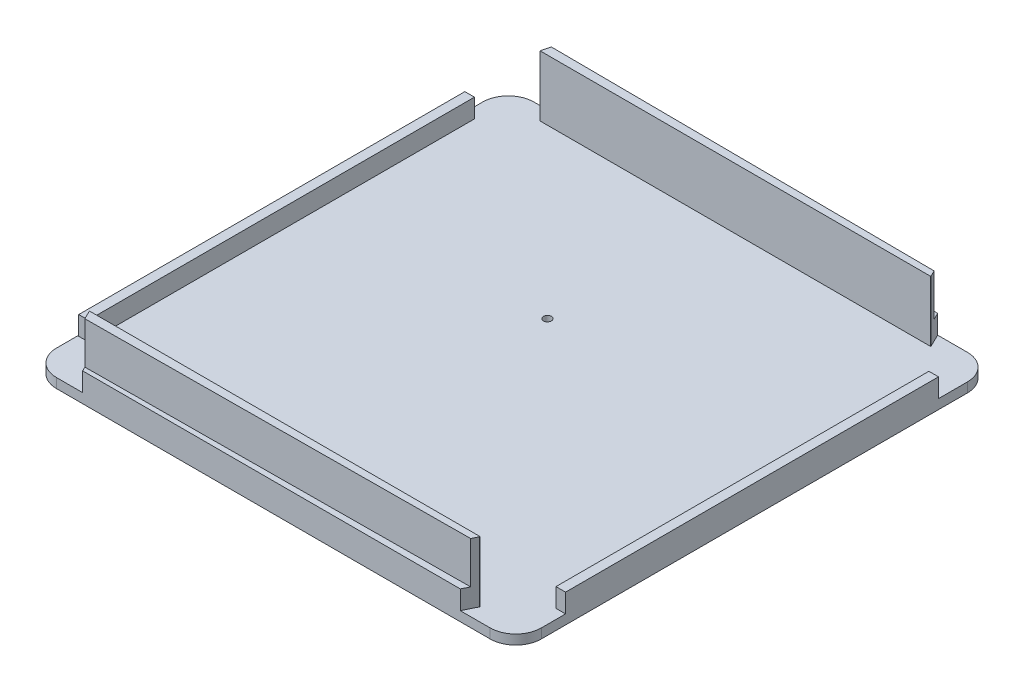
ISO-10303-21;
HEADER;
FILE_DESCRIPTION(('STEP AP214'),'2;1');
FILE_NAME('part.step','',(''),(''),'','','');
FILE_SCHEMA(('AUTOMOTIVE_DESIGN { 1 0 10303 214 1 1 1 1 }'));
ENDSEC;
DATA;
#1=APPLICATION_CONTEXT('core data for automotive mechanical design processes');
#2=APPLICATION_PROTOCOL_DEFINITION('international standard','automotive_design',2000,#1);
#3=PRODUCT_CONTEXT('',#1,'mechanical');
#4=PRODUCT('Part','Part','',(#3));
#5=PRODUCT_RELATED_PRODUCT_CATEGORY('part','',(#4));
#6=PRODUCT_DEFINITION_FORMATION('','',#4);
#7=PRODUCT_DEFINITION_CONTEXT('part definition',#1,'design');
#8=PRODUCT_DEFINITION('design','',#6,#7);
#9=PRODUCT_DEFINITION_SHAPE('','',#8);
#10=(LENGTH_UNIT() NAMED_UNIT(*) SI_UNIT(.MILLI.,.METRE.));
#11=(NAMED_UNIT(*) PLANE_ANGLE_UNIT() SI_UNIT($,.RADIAN.));
#12=(NAMED_UNIT(*) SI_UNIT($,.STERADIAN.) SOLID_ANGLE_UNIT());
#13=UNCERTAINTY_MEASURE_WITH_UNIT(LENGTH_MEASURE(1.E-05),#10,'distance_accuracy_value','');
#14=(GEOMETRIC_REPRESENTATION_CONTEXT(3) GLOBAL_UNCERTAINTY_ASSIGNED_CONTEXT((#13)) GLOBAL_UNIT_ASSIGNED_CONTEXT((#10,
#11,#12)) REPRESENTATION_CONTEXT('',''));
#15=CARTESIAN_POINT('',(0.,0.,0.));
#16=DIRECTION('',(0.,0.,1.));
#17=DIRECTION('',(1.,0.,0.));
#18=AXIS2_PLACEMENT_3D('',#15,#16,#17);
#19=CARTESIAN_POINT('',(0.,3.,0.));
#20=DIRECTION('',(0.,1.,0.));
#21=DIRECTION('',(0.,0.,1.));
#22=AXIS2_PLACEMENT_3D('',#19,#20,#21);
#23=PLANE('',#22);
#24=CARTESIAN_POINT('',(-6.84214841799877,3.,-18.2153744941005));
#25=DIRECTION('',(0.,1.,0.));
#26=DIRECTION('',(0.,0.,1.));
#27=AXIS2_PLACEMENT_3D('',#24,#25,#26);
#28=CIRCLE('',#27,1.25);
#29=CARTESIAN_POINT('',(-6.84214841799877,3.,-16.9653744941005));
#30=VERTEX_POINT('',#29);
#31=EDGE_CURVE('E407',#30,#30,#28,.T.);
#32=ORIENTED_EDGE('',*,*,#31,.F.);
#33=EDGE_LOOP('',(#32));
#34=FACE_BOUND('',#33,.T.);
#35=DIRECTION('',(-1.,0.,0.));
#36=VECTOR('',#35,1.);
#37=CARTESIAN_POINT('',(-72.3411095081286,3.,-60.8898198515249));
#38=LINE('',#37,#36);
#39=CARTESIAN_POINT('',(-72.3411095081286,3.,-60.8898198515249));
#40=VERTEX_POINT('',#39);
#41=CARTESIAN_POINT('',(-75.3411095081286,3.,-60.8898198515249));
#42=VERTEX_POINT('',#41);
#43=EDGE_CURVE('E289',#40,#42,#38,.T.);
#44=ORIENTED_EDGE('',*,*,#43,.F.);
#45=DIRECTION('',(0.,0.,-1.));
#46=VECTOR('',#45,1.);
#47=CARTESIAN_POINT('',(-72.3411095081286,3.,-60.8898198515249));
#48=LINE('',#47,#46);
#49=CARTESIAN_POINT('',(-72.3411095081285,3.,59.8481432423194));
#50=VERTEX_POINT('',#49);
#51=EDGE_CURVE('E284',#50,#40,#48,.T.);
#52=ORIENTED_EDGE('',*,*,#51,.F.);
#53=DIRECTION('',(1.,0.,0.));
#54=VECTOR('',#53,1.);
#55=CARTESIAN_POINT('',(-72.3411095081285,3.,59.8481432423194));
#56=LINE('',#55,#54);
#57=CARTESIAN_POINT('',(-75.3411095081285,3.,59.8481432423194));
#58=VERTEX_POINT('',#57);
#59=EDGE_CURVE('E300',#58,#50,#56,.T.);
#60=ORIENTED_EDGE('',*,*,#59,.F.);
#61=DIRECTION('',(0.,0.,1.));
#62=VECTOR('',#61,1.);
#63=CARTESIAN_POINT('',(-75.3411095081286,3.,-60.8898198515249));
#64=LINE('',#63,#62);
#65=EDGE_CURVE('E312',#42,#58,#64,.T.);
#66=ORIENTED_EDGE('',*,*,#65,.F.);
#67=EDGE_LOOP('',(#44,#52,#60,#66));
#68=FACE_BOUND('',#67,.T.);
#69=DIRECTION('',(0.,0.,1.));
#70=VECTOR('',#69,1.);
#71=CARTESIAN_POINT('',(72.9521777403219,3.,-57.7072936197818));
#72=LINE('',#71,#70);
#73=CARTESIAN_POINT('',(72.9521777403219,3.,-57.7072936197818));
#74=VERTEX_POINT('',#73);
#75=CARTESIAN_POINT('',(72.9521777403219,3.,58.917668749082));
#76=VERTEX_POINT('',#75);
#77=EDGE_CURVE('E64',#74,#76,#72,.T.);
#78=ORIENTED_EDGE('',*,*,#77,.F.);
#79=DIRECTION('',(-1.,0.,0.));
#80=VECTOR('',#79,1.);
#81=CARTESIAN_POINT('',(75.9521777403219,3.,-57.7072936197818));
#82=LINE('',#81,#80);
#83=CARTESIAN_POINT('',(75.9521777403219,3.,-57.7072936197818));
#84=VERTEX_POINT('',#83);
#85=EDGE_CURVE('E650',#84,#74,#82,.T.);
#86=ORIENTED_EDGE('',*,*,#85,.F.);
#87=DIRECTION('',(0.,0.,-1.));
#88=VECTOR('',#87,1.);
#89=CARTESIAN_POINT('',(75.9521777403219,3.,74.4953557140405));
#90=LINE('',#89,#88);
#91=CARTESIAN_POINT('',(75.9521777403219,3.,-66.7664054436027));
#92=VERTEX_POINT('',#91);
#93=EDGE_CURVE('E282',#84,#92,#90,.T.);
#94=ORIENTED_EDGE('',*,*,#93,.T.);
#95=CARTESIAN_POINT('',(67.9521777403219,3.,-66.7664054436027));
#96=DIRECTION('',(0.,1.,0.));
#97=DIRECTION('',(0.,0.,1.));
#98=AXIS2_PLACEMENT_3D('',#95,#96,#97);
#99=CIRCLE('',#98,8.);
#100=CARTESIAN_POINT('',(67.9521777403219,3.,-74.7664054436027));
#101=VERTEX_POINT('',#100);
#102=EDGE_CURVE('E482',#92,#101,#99,.T.);
#103=ORIENTED_EDGE('',*,*,#102,.T.);
#104=DIRECTION('',(-1.,0.,0.));
#105=VECTOR('',#104,1.);
#106=CARTESIAN_POINT('',(75.9521777403219,3.,-74.7664054436027));
#107=LINE('',#106,#105);
#108=CARTESIAN_POINT('',(58.6343494937738,3.,-74.7664054436027));
#109=VERTEX_POINT('',#108);
#110=EDGE_CURVE('E420',#101,#109,#107,.T.);
#111=ORIENTED_EDGE('',*,*,#110,.T.);
#112=DIRECTION('',(-0.438371146789076,0.,-0.898794046299168));
#113=VECTOR('',#112,1.);
#114=CARTESIAN_POINT('',(60.6072716090886,3.,-70.7213156514361));
#115=LINE('',#114,#113);
#116=CARTESIAN_POINT('',(60.6198197378327,3.,-70.6955881748674));
#117=VERTEX_POINT('',#116);
#118=EDGE_CURVE('E536',#109,#117,#115,.F.);
#119=ORIENTED_EDGE('',*,*,#118,.T.);
#120=DIRECTION('',(0.,0.,-1.));
#121=VECTOR('',#120,1.);
#122=CARTESIAN_POINT('',(60.6198197378327,3.,-72.5958456630464));
#123=LINE('',#122,#121);
#124=CARTESIAN_POINT('',(60.6198197378327,3.,-70.5958456630464));
#125=VERTEX_POINT('',#124);
#126=EDGE_CURVE('E381',#125,#117,#123,.T.);
#127=ORIENTED_EDGE('',*,*,#126,.F.);
#128=DIRECTION('',(1.,0.,0.));
#129=VECTOR('',#128,1.);
#130=CARTESIAN_POINT('',(60.6198197378327,3.,-70.5958456630464));
#131=LINE('',#130,#129);
#132=CARTESIAN_POINT('',(-61.4891703330126,3.,-70.5958456630464));
#133=VERTEX_POINT('',#132);
#134=EDGE_CURVE('E394',#133,#125,#131,.T.);
#135=ORIENTED_EDGE('',*,*,#134,.F.);
#136=DIRECTION('',(0.,0.,1.));
#137=VECTOR('',#136,1.);
#138=CARTESIAN_POINT('',(-61.4891703330126,3.,-70.5958456630464));
#139=LINE('',#138,#137);
#140=CARTESIAN_POINT('',(-61.4891703330126,3.,-70.7192945560634));
#141=VERTEX_POINT('',#140);
#142=EDGE_CURVE('E373',#141,#133,#139,.T.);
#143=ORIENTED_EDGE('',*,*,#142,.F.);
#144=DIRECTION('',(-0.241921895599669,0.,0.970295726275996));
#145=VECTOR('',#144,1.);
#146=CARTESIAN_POINT('',(-61.5077011926725,3.,-70.6449713374575));
#147=LINE('',#146,#145);
#148=CARTESIAN_POINT('',(-60.4801122581375,3.,-74.7664054436027));
#149=VERTEX_POINT('',#148);
#150=EDGE_CURVE('E516',#141,#149,#147,.F.);
#151=ORIENTED_EDGE('',*,*,#150,.T.);
#152=CARTESIAN_POINT('',(-67.6384273342049,3.,-74.7664054436027));
#153=VERTEX_POINT('',#152);
#154=EDGE_CURVE('E419',#149,#153,#107,.T.);
#155=ORIENTED_EDGE('',*,*,#154,.T.);
#156=CARTESIAN_POINT('',(-67.6384273342049,3.,-66.7664054436027));
#157=DIRECTION('',(0.,1.,0.));
#158=DIRECTION('',(0.,0.,1.));
#159=AXIS2_PLACEMENT_3D('',#156,#157,#158);
#160=CIRCLE('',#159,8.);
#161=CARTESIAN_POINT('',(-75.6384273342049,3.,-66.7664054436027));
#162=VERTEX_POINT('',#161);
#163=EDGE_CURVE('E472',#153,#162,#160,.T.);
#164=ORIENTED_EDGE('',*,*,#163,.T.);
#165=DIRECTION('',(0.,0.,-1.));
#166=VECTOR('',#165,1.);
#167=CARTESIAN_POINT('',(-75.6384273342049,3.,74.4953557140405));
#168=LINE('',#167,#166);
#169=CARTESIAN_POINT('',(-75.6384273342049,3.,66.4953557140405));
#170=VERTEX_POINT('',#169);
#171=EDGE_CURVE('E423',#170,#162,#168,.T.);
#172=ORIENTED_EDGE('',*,*,#171,.F.);
#173=CARTESIAN_POINT('',(-67.6384273342049,3.,66.4953557140405));
#174=DIRECTION('',(0.,1.,0.));
#175=DIRECTION('',(0.,0.,1.));
#176=AXIS2_PLACEMENT_3D('',#173,#174,#175);
#177=CIRCLE('',#176,8.);
#178=CARTESIAN_POINT('',(-67.6384273342049,3.,74.4953557140405));
#179=VERTEX_POINT('',#178);
#180=EDGE_CURVE('E475',#170,#179,#177,.T.);
#181=ORIENTED_EDGE('',*,*,#180,.T.);
#182=DIRECTION('',(-1.,0.,0.));
#183=VECTOR('',#182,1.);
#184=CARTESIAN_POINT('',(75.9521777403219,3.,74.4953557140405));
#185=LINE('',#184,#183);
#186=CARTESIAN_POINT('',(-59.4801122581376,3.,74.4953557140405));
#187=VERTEX_POINT('',#186);
#188=EDGE_CURVE('E427',#187,#179,#185,.T.);
#189=ORIENTED_EDGE('',*,*,#188,.F.);
#190=DIRECTION('',(-0.438371146789072,0.,-0.89879404629917));
#191=VECTOR('',#190,1.);
#192=CARTESIAN_POINT('',(-59.4801122581376,3.,74.4953557140405));
#193=LINE('',#192,#191);
#194=CARTESIAN_POINT('',(-61.4891703330126,3.,70.3761762251682));
#195=VERTEX_POINT('',#194);
#196=EDGE_CURVE('E558',#187,#195,#193,.T.);
#197=ORIENTED_EDGE('',*,*,#196,.T.);
#198=DIRECTION('',(0.,0.,-1.));
#199=VECTOR('',#198,1.);
#200=CARTESIAN_POINT('',(-61.4891703330126,3.,70.3247959334841));
#201=LINE('',#200,#199);
#202=CARTESIAN_POINT('',(-61.4891703330126,3.,70.3247959334841));
#203=VERTEX_POINT('',#202);
#204=EDGE_CURVE('E337',#195,#203,#201,.T.);
#205=ORIENTED_EDGE('',*,*,#204,.T.);
#206=DIRECTION('',(1.,0.,0.));
#207=VECTOR('',#206,1.);
#208=CARTESIAN_POINT('',(60.6198197378327,3.,70.3247959334841));
#209=LINE('',#208,#207);
#210=CARTESIAN_POINT('',(60.6198197378327,3.,70.3247959334841));
#211=VERTEX_POINT('',#210);
#212=EDGE_CURVE('E342',#203,#211,#209,.T.);
#213=ORIENTED_EDGE('',*,*,#212,.T.);
#214=DIRECTION('',(0.,0.,1.));
#215=VECTOR('',#214,1.);
#216=CARTESIAN_POINT('',(60.6198197378327,3.,72.3247959334841));
#217=LINE('',#216,#215);
#218=CARTESIAN_POINT('',(60.6198197378327,3.,70.4245384453051));
#219=VERTEX_POINT('',#218);
#220=EDGE_CURVE('E356',#211,#219,#217,.T.);
#221=ORIENTED_EDGE('',*,*,#220,.T.);
#222=DIRECTION('',(-0.438371146789073,0.,0.898794046299169));
#223=VECTOR('',#222,1.);
#224=CARTESIAN_POINT('',(58.6343494937738,3.,74.4953557140405));
#225=LINE('',#224,#223);
#226=CARTESIAN_POINT('',(58.6343494937738,3.,74.4953557140405));
#227=VERTEX_POINT('',#226);
#228=EDGE_CURVE('E11',#219,#227,#225,.T.);
#229=ORIENTED_EDGE('',*,*,#228,.T.);
#230=CARTESIAN_POINT('',(67.9521777403219,3.,74.4953557140405));
#231=VERTEX_POINT('',#230);
#232=EDGE_CURVE('E428',#231,#227,#185,.T.);
#233=ORIENTED_EDGE('',*,*,#232,.F.);
#234=CARTESIAN_POINT('',(67.9521777403219,3.,66.4953557140405));
#235=DIRECTION('',(0.,1.,0.));
#236=DIRECTION('',(0.,0.,1.));
#237=AXIS2_PLACEMENT_3D('',#234,#235,#236);
#238=CIRCLE('',#237,8.);
#239=CARTESIAN_POINT('',(75.9521777403219,3.,66.4953557140405));
#240=VERTEX_POINT('',#239);
#241=EDGE_CURVE('E479',#231,#240,#238,.T.);
#242=ORIENTED_EDGE('',*,*,#241,.T.);
#243=CARTESIAN_POINT('',(75.9521777403219,3.,58.917668749082));
#244=VERTEX_POINT('',#243);
#245=EDGE_CURVE('E416',#240,#244,#90,.T.);
#246=ORIENTED_EDGE('',*,*,#245,.T.);
#247=DIRECTION('',(1.,0.,0.));
#248=VECTOR('',#247,1.);
#249=CARTESIAN_POINT('',(75.9521777403219,3.,58.917668749082));
#250=LINE('',#249,#248);
#251=EDGE_CURVE('E69',#76,#244,#250,.T.);
#252=ORIENTED_EDGE('',*,*,#251,.F.);
#253=EDGE_LOOP('',(#78,#86,#94,#103,#111,#119,#127,#135,#143,#151,#155,#164,#172,#181,#189,#197,
#205,#213,#221,#229,#233,#242,#246,#252));
#254=FACE_BOUND('',#253,.T.);
#255=ADVANCED_FACE('F47',(#34,#68,#254),#23,.T.);
#256=CARTESIAN_POINT('',(-61.4891703330126,22.,73.142195131537));
#257=DIRECTION('',(0.00669386328100241,0.,0.999977595846215));
#258=DIRECTION('',(0.999977595846215,0.,-0.00669386328100241));
#259=AXIS2_PLACEMENT_3D('',#256,#257,#258);
#260=PLANE('',#259);
#261=DIRECTION('',(-0.999977595846215,0.,0.00669386328100235));
#262=VECTOR('',#261,1.);
#263=CARTESIAN_POINT('',(60.6198197378327,8.9,72.3247959334842));
#264=LINE('',#263,#262);
#265=CARTESIAN_POINT('',(59.6899663666846,8.9,72.3310203842755));
#266=VERTEX_POINT('',#265);
#267=CARTESIAN_POINT('',(-60.1444830257952,8.89999999999999,73.133193776879));
#268=VERTEX_POINT('',#267);
#269=EDGE_CURVE('E331',#266,#268,#264,.T.);
#270=ORIENTED_EDGE('',*,*,#269,.F.);
#271=DIRECTION('',(0.,1.,0.));
#272=VECTOR('',#271,1.);
#273=CARTESIAN_POINT('',(59.6899663666846,22.,72.3310203842755));
#274=LINE('',#273,#272);
#275=CARTESIAN_POINT('',(59.6899663666846,22.,72.3310203842755));
#276=VERTEX_POINT('',#275);
#277=EDGE_CURVE('E568',#266,#276,#274,.T.);
#278=ORIENTED_EDGE('',*,*,#277,.T.);
#279=DIRECTION('',(-0.999977595846215,0.,0.00669386328100241));
#280=VECTOR('',#279,1.);
#281=CARTESIAN_POINT('',(-61.4891703330126,22.,73.142195131537));
#282=LINE('',#281,#280);
#283=CARTESIAN_POINT('',(-60.1444830257952,22.,73.133193776879));
#284=VERTEX_POINT('',#283);
#285=EDGE_CURVE('E341',#276,#284,#282,.T.);
#286=ORIENTED_EDGE('',*,*,#285,.T.);
#287=DIRECTION('',(0.,-1.,0.));
#288=VECTOR('',#287,1.);
#289=CARTESIAN_POINT('',(-60.1444830257952,22.,73.133193776879));
#290=LINE('',#289,#288);
#291=EDGE_CURVE('E550',#284,#268,#290,.T.);
#292=ORIENTED_EDGE('',*,*,#291,.T.);
#293=EDGE_LOOP('',(#270,#278,#286,#292));
#294=FACE_BOUND('',#293,.T.);
#295=ADVANCED_FACE('F666',(#294),#260,.T.);
#296=CARTESIAN_POINT('',(-61.4891703330126,22.,-73.4132448610992));
#297=DIRECTION('',(-0.00669386328100223,0.,0.999977595846215));
#298=DIRECTION('',(0.999977595846215,0.,0.00669386328100223));
#299=AXIS2_PLACEMENT_3D('',#296,#297,#298);
#300=PLANE('',#299);
#301=DIRECTION('',(-0.999977595846215,0.,-0.00669386328100223));
#302=VECTOR('',#301,1.);
#303=CARTESIAN_POINT('',(-61.4891703330126,22.,-73.4132448610992));
#304=LINE('',#303,#302);
#305=CARTESIAN_POINT('',(59.6899663666846,22.,-72.6020701138378));
#306=VERTEX_POINT('',#305);
#307=CARTESIAN_POINT('',(-60.8186122484655,22.,-73.4087561363932));
#308=VERTEX_POINT('',#307);
#309=EDGE_CURVE('E388',#306,#308,#304,.T.);
#310=ORIENTED_EDGE('',*,*,#309,.F.);
#311=DIRECTION('',(0.,1.,0.));
#312=VECTOR('',#311,1.);
#313=CARTESIAN_POINT('',(59.6899663666846,3.,-72.6020701138378));
#314=LINE('',#313,#312);
#315=CARTESIAN_POINT('',(59.6899663666846,8.89999999999999,-72.6020701138378));
#316=VERTEX_POINT('',#315);
#317=EDGE_CURVE('E526',#306,#316,#314,.F.);
#318=ORIENTED_EDGE('',*,*,#317,.T.);
#319=DIRECTION('',(0.999977595846215,0.,0.00669386328100235));
#320=VECTOR('',#319,1.);
#321=CARTESIAN_POINT('',(-61.4891703330126,8.9,-73.4132448610993));
#322=LINE('',#321,#320);
#323=CARTESIAN_POINT('',(-60.8186122484655,8.9,-73.4087561363933));
#324=VERTEX_POINT('',#323);
#325=EDGE_CURVE('E369',#324,#316,#322,.T.);
#326=ORIENTED_EDGE('',*,*,#325,.F.);
#327=DIRECTION('',(0.,-1.,0.));
#328=VECTOR('',#327,1.);
#329=CARTESIAN_POINT('',(-60.8186122484655,3.,-73.4087561363932));
#330=LINE('',#329,#328);
#331=EDGE_CURVE('E509',#324,#308,#330,.F.);
#332=ORIENTED_EDGE('',*,*,#331,.T.);
#333=EDGE_LOOP('',(#310,#318,#326,#332));
#334=FACE_BOUND('',#333,.T.);
#335=ADVANCED_FACE('F674',(#334),#300,.F.);
#336=CARTESIAN_POINT('',(75.9521777403219,3.,74.4953557140405));
#337=DIRECTION('',(-1.,0.,0.));
#338=DIRECTION('',(0.,0.,1.));
#339=AXIS2_PLACEMENT_3D('',#336,#337,#338);
#340=PLANE('',#339);
#341=DIRECTION('',(0.,0.,-1.));
#342=VECTOR('',#341,1.);
#343=CARTESIAN_POINT('',(75.9521777403219,0.,74.4953557140405));
#344=LINE('',#343,#342);
#345=CARTESIAN_POINT('',(75.9521777403219,0.,66.4953557140405));
#346=VERTEX_POINT('',#345);
#347=CARTESIAN_POINT('',(75.9521777403219,0.,-66.7664054436027));
#348=VERTEX_POINT('',#347);
#349=EDGE_CURVE('E412',#346,#348,#344,.T.);
#350=ORIENTED_EDGE('',*,*,#349,.T.);
#351=DIRECTION('',(0.,-1.,0.));
#352=VECTOR('',#351,1.);
#353=CARTESIAN_POINT('',(75.9521777403219,3.,-66.7664054436027));
#354=LINE('',#353,#352);
#355=EDGE_CURVE('E469',#348,#92,#354,.F.);
#356=ORIENTED_EDGE('',*,*,#355,.T.);
#357=ORIENTED_EDGE('',*,*,#93,.F.);
#358=DIRECTION('',(0.,-1.,0.));
#359=VECTOR('',#358,1.);
#360=CARTESIAN_POINT('',(75.9521777403219,8.9,-57.7072936197818));
#361=LINE('',#360,#359);
#362=CARTESIAN_POINT('',(75.9521777403219,8.9,-57.7072936197818));
#363=VERTEX_POINT('',#362);
#364=EDGE_CURVE('E261',#363,#84,#361,.T.);
#365=ORIENTED_EDGE('',*,*,#364,.F.);
#366=DIRECTION('',(0.,0.,-1.));
#367=VECTOR('',#366,1.);
#368=CARTESIAN_POINT('',(75.9521777403219,8.9,-57.7072936197818));
#369=LINE('',#368,#367);
#370=CARTESIAN_POINT('',(75.9521777403219,8.9,58.917668749082));
#371=VERTEX_POINT('',#370);
#372=EDGE_CURVE('E268',#371,#363,#369,.T.);
#373=ORIENTED_EDGE('',*,*,#372,.F.);
#374=DIRECTION('',(0.,-1.,0.));
#375=VECTOR('',#374,1.);
#376=CARTESIAN_POINT('',(75.9521777403219,8.9,58.917668749082));
#377=LINE('',#376,#375);
#378=EDGE_CURVE('E638',#371,#244,#377,.T.);
#379=ORIENTED_EDGE('',*,*,#378,.T.);
#380=ORIENTED_EDGE('',*,*,#245,.F.);
#381=DIRECTION('',(0.,-1.,0.));
#382=VECTOR('',#381,1.);
#383=CARTESIAN_POINT('',(75.9521777403219,0.,66.4953557140405));
#384=LINE('',#383,#382);
#385=EDGE_CURVE('E465',#240,#346,#384,.T.);
#386=ORIENTED_EDGE('',*,*,#385,.T.);
#387=EDGE_LOOP('',(#350,#356,#357,#365,#373,#379,#380,#386));
#388=FACE_BOUND('',#387,.T.);
#389=ADVANCED_FACE('F280',(#388),#340,.F.);
#390=CARTESIAN_POINT('',(75.9521777403219,3.,-74.7664054436027));
#391=DIRECTION('',(0.,0.,1.));
#392=DIRECTION('',(1.,0.,0.));
#393=AXIS2_PLACEMENT_3D('',#390,#391,#392);
#394=PLANE('',#393);
#395=DIRECTION('',(-1.,0.,0.));
#396=VECTOR('',#395,1.);
#397=CARTESIAN_POINT('',(-60.6590145091555,8.9,-74.7664054436027));
#398=LINE('',#397,#396);
#399=CARTESIAN_POINT('',(58.6343494937738,8.89999999999999,-74.7664054436027));
#400=VERTEX_POINT('',#399);
#401=CARTESIAN_POINT('',(-60.4801122581375,8.9,-74.7664054436027));
#402=VERTEX_POINT('',#401);
#403=EDGE_CURVE('E370',#400,#402,#398,.T.);
#404=ORIENTED_EDGE('',*,*,#403,.F.);
#405=DIRECTION('',(0.,-1.,0.));
#406=VECTOR('',#405,1.);
#407=CARTESIAN_POINT('',(58.6343494937738,3.,-74.7664054436027));
#408=LINE('',#407,#406);
#409=EDGE_CURVE('E532',#400,#109,#408,.T.);
#410=ORIENTED_EDGE('',*,*,#409,.T.);
#411=ORIENTED_EDGE('',*,*,#110,.F.);
#412=DIRECTION('',(0.,-1.,0.));
#413=VECTOR('',#412,1.);
#414=CARTESIAN_POINT('',(67.9521777403219,3.,-74.7664054436027));
#415=LINE('',#414,#413);
#416=CARTESIAN_POINT('',(67.9521777403219,0.,-74.7664054436027));
#417=VERTEX_POINT('',#416);
#418=EDGE_CURVE('E449',#101,#417,#415,.T.);
#419=ORIENTED_EDGE('',*,*,#418,.T.);
#420=DIRECTION('',(-1.,0.,0.));
#421=VECTOR('',#420,1.);
#422=CARTESIAN_POINT('',(75.9521777403219,0.,-74.7664054436027));
#423=LINE('',#422,#421);
#424=CARTESIAN_POINT('',(-67.6384273342049,0.,-74.7664054436027));
#425=VERTEX_POINT('',#424);
#426=EDGE_CURVE('E434',#417,#425,#423,.T.);
#427=ORIENTED_EDGE('',*,*,#426,.T.);
#428=DIRECTION('',(0.,-1.,0.));
#429=VECTOR('',#428,1.);
#430=CARTESIAN_POINT('',(-67.6384273342049,3.,-74.7664054436027));
#431=LINE('',#430,#429);
#432=EDGE_CURVE('E431',#425,#153,#431,.F.);
#433=ORIENTED_EDGE('',*,*,#432,.T.);
#434=ORIENTED_EDGE('',*,*,#154,.F.);
#435=DIRECTION('',(0.,1.,0.));
#436=VECTOR('',#435,1.);
#437=CARTESIAN_POINT('',(-60.4801122581375,3.,-74.7664054436027));
#438=LINE('',#437,#436);
#439=EDGE_CURVE('E499',#149,#402,#438,.T.);
#440=ORIENTED_EDGE('',*,*,#439,.T.);
#441=EDGE_LOOP('',(#404,#410,#411,#419,#427,#433,#434,#440));
#442=FACE_BOUND('',#441,.T.);
#443=ADVANCED_FACE('F621',(#442),#394,.F.);
#444=CARTESIAN_POINT('',(-75.6384273342049,3.,74.4953557140405));
#445=DIRECTION('',(-1.,0.,0.));
#446=DIRECTION('',(0.,0.,1.));
#447=AXIS2_PLACEMENT_3D('',#444,#445,#446);
#448=PLANE('',#447);
#449=DIRECTION('',(0.,0.,-1.));
#450=VECTOR('',#449,1.);
#451=CARTESIAN_POINT('',(-75.6384273342049,0.,74.4953557140405));
#452=LINE('',#451,#450);
#453=CARTESIAN_POINT('',(-75.6384273342049,0.,66.4953557140405));
#454=VERTEX_POINT('',#453);
#455=CARTESIAN_POINT('',(-75.6384273342049,0.,-66.7664054436027));
#456=VERTEX_POINT('',#455);
#457=EDGE_CURVE('E438',#454,#456,#452,.T.);
#458=ORIENTED_EDGE('',*,*,#457,.F.);
#459=DIRECTION('',(0.,-1.,0.));
#460=VECTOR('',#459,1.);
#461=CARTESIAN_POINT('',(-75.6384273342049,3.,66.4953557140405));
#462=LINE('',#461,#460);
#463=EDGE_CURVE('E496',#454,#170,#462,.F.);
#464=ORIENTED_EDGE('',*,*,#463,.T.);
#465=ORIENTED_EDGE('',*,*,#171,.T.);
#466=DIRECTION('',(0.,-1.,0.));
#467=VECTOR('',#466,1.);
#468=CARTESIAN_POINT('',(-75.6384273342049,0.,-66.7664054436027));
#469=LINE('',#468,#467);
#470=EDGE_CURVE('E492',#162,#456,#469,.T.);
#471=ORIENTED_EDGE('',*,*,#470,.T.);
#472=EDGE_LOOP('',(#458,#464,#465,#471));
#473=FACE_BOUND('',#472,.T.);
#474=ADVANCED_FACE('F613',(#473),#448,.T.);
#475=CARTESIAN_POINT('',(75.9521777403219,3.,74.4953557140405));
#476=DIRECTION('',(0.,0.,1.));
#477=DIRECTION('',(1.,0.,0.));
#478=AXIS2_PLACEMENT_3D('',#475,#476,#477);
#479=PLANE('',#478);
#480=ORIENTED_EDGE('',*,*,#232,.T.);
#481=DIRECTION('',(0.,1.,0.));
#482=VECTOR('',#481,1.);
#483=CARTESIAN_POINT('',(58.6343494937738,8.9,74.4953557140405));
#484=LINE('',#483,#482);
#485=CARTESIAN_POINT('',(58.6343494937738,8.9,74.4953557140405));
#486=VERTEX_POINT('',#485);
#487=EDGE_CURVE('E561',#227,#486,#484,.T.);
#488=ORIENTED_EDGE('',*,*,#487,.T.);
#489=DIRECTION('',(-1.,0.,0.));
#490=VECTOR('',#489,1.);
#491=CARTESIAN_POINT('',(61.4499755616898,8.9,74.4953557140405));
#492=LINE('',#491,#490);
#493=CARTESIAN_POINT('',(-59.4801122581375,8.89999999999999,74.4953557140405));
#494=VERTEX_POINT('',#493);
#495=EDGE_CURVE('E334',#486,#494,#492,.T.);
#496=ORIENTED_EDGE('',*,*,#495,.T.);
#497=DIRECTION('',(0.,-1.,0.));
#498=VECTOR('',#497,1.);
#499=CARTESIAN_POINT('',(-59.4801122581376,3.,74.4953557140405));
#500=LINE('',#499,#498);
#501=EDGE_CURVE('E539',#494,#187,#500,.T.);
#502=ORIENTED_EDGE('',*,*,#501,.T.);
#503=ORIENTED_EDGE('',*,*,#188,.T.);
#504=DIRECTION('',(0.,-1.,0.));
#505=VECTOR('',#504,1.);
#506=CARTESIAN_POINT('',(-67.6384273342049,3.,74.4953557140405));
#507=LINE('',#506,#505);
#508=CARTESIAN_POINT('',(-67.6384273342049,0.,74.4953557140405));
#509=VERTEX_POINT('',#508);
#510=EDGE_CURVE('E485',#179,#509,#507,.T.);
#511=ORIENTED_EDGE('',*,*,#510,.T.);
#512=DIRECTION('',(-1.,0.,0.));
#513=VECTOR('',#512,1.);
#514=CARTESIAN_POINT('',(75.9521777403219,0.,74.4953557140405));
#515=LINE('',#514,#513);
#516=CARTESIAN_POINT('',(67.9521777403219,0.,74.4953557140405));
#517=VERTEX_POINT('',#516);
#518=EDGE_CURVE('E442',#517,#509,#515,.T.);
#519=ORIENTED_EDGE('',*,*,#518,.F.);
#520=DIRECTION('',(0.,-1.,0.));
#521=VECTOR('',#520,1.);
#522=CARTESIAN_POINT('',(67.9521777403219,3.,74.4953557140405));
#523=LINE('',#522,#521);
#524=EDGE_CURVE('E489',#517,#231,#523,.F.);
#525=ORIENTED_EDGE('',*,*,#524,.T.);
#526=EDGE_LOOP('',(#480,#488,#496,#502,#503,#511,#519,#525));
#527=FACE_BOUND('',#526,.T.);
#528=ADVANCED_FACE('F588',(#527),#479,.T.);
#529=CARTESIAN_POINT('',(0.,0.,0.));
#530=DIRECTION('',(0.,1.,0.));
#531=DIRECTION('',(0.,0.,1.));
#532=AXIS2_PLACEMENT_3D('',#529,#530,#531);
#533=PLANE('',#532);
#534=CARTESIAN_POINT('',(-6.84214841799877,0.,-18.2153744941005));
#535=DIRECTION('',(0.,1.,0.));
#536=DIRECTION('',(0.,0.,1.));
#537=AXIS2_PLACEMENT_3D('',#534,#535,#536);
#538=CIRCLE('',#537,1.25);
#539=CARTESIAN_POINT('',(-6.84214841799877,0.,-16.9653744941005));
#540=VERTEX_POINT('',#539);
#541=EDGE_CURVE('E408',#540,#540,#538,.T.);
#542=ORIENTED_EDGE('',*,*,#541,.T.);
#543=EDGE_LOOP('',(#542));
#544=FACE_BOUND('',#543,.T.);
#545=ORIENTED_EDGE('',*,*,#426,.F.);
#546=CARTESIAN_POINT('',(67.9521777403219,0.,-66.7664054436027));
#547=DIRECTION('',(0.,1.,0.));
#548=DIRECTION('',(0.,0.,1.));
#549=AXIS2_PLACEMENT_3D('',#546,#547,#548);
#550=CIRCLE('',#549,8.);
#551=EDGE_CURVE('E462',#417,#348,#550,.F.);
#552=ORIENTED_EDGE('',*,*,#551,.T.);
#553=ORIENTED_EDGE('',*,*,#349,.F.);
#554=CARTESIAN_POINT('',(67.9521777403219,0.,66.4953557140405));
#555=DIRECTION('',(0.,1.,0.));
#556=DIRECTION('',(0.,0.,1.));
#557=AXIS2_PLACEMENT_3D('',#554,#555,#556);
#558=CIRCLE('',#557,8.);
#559=EDGE_CURVE('E459',#346,#517,#558,.F.);
#560=ORIENTED_EDGE('',*,*,#559,.T.);
#561=ORIENTED_EDGE('',*,*,#518,.T.);
#562=CARTESIAN_POINT('',(-67.6384273342049,0.,66.4953557140405));
#563=DIRECTION('',(0.,1.,0.));
#564=DIRECTION('',(0.,0.,1.));
#565=AXIS2_PLACEMENT_3D('',#562,#563,#564);
#566=CIRCLE('',#565,8.);
#567=EDGE_CURVE('E456',#509,#454,#566,.F.);
#568=ORIENTED_EDGE('',*,*,#567,.T.);
#569=ORIENTED_EDGE('',*,*,#457,.T.);
#570=CARTESIAN_POINT('',(-67.6384273342049,0.,-66.7664054436027));
#571=DIRECTION('',(0.,1.,0.));
#572=DIRECTION('',(0.,0.,1.));
#573=AXIS2_PLACEMENT_3D('',#570,#571,#572);
#574=CIRCLE('',#573,8.);
#575=EDGE_CURVE('E453',#456,#425,#574,.F.);
#576=ORIENTED_EDGE('',*,*,#575,.T.);
#577=EDGE_LOOP('',(#545,#552,#553,#560,#561,#568,#569,#576));
#578=FACE_BOUND('',#577,.T.);
#579=ADVANCED_FACE('F611',(#544,#578),#533,.F.);
#580=CARTESIAN_POINT('',(67.9521777403219,3.,-66.7664054436027));
#581=DIRECTION('',(0.,-1.,0.));
#582=DIRECTION('',(0.,0.,-1.));
#583=AXIS2_PLACEMENT_3D('',#580,#581,#582);
#584=CYLINDRICAL_SURFACE('',#583,8.);
#585=ORIENTED_EDGE('',*,*,#102,.F.);
#586=ORIENTED_EDGE('',*,*,#355,.F.);
#587=ORIENTED_EDGE('',*,*,#551,.F.);
#588=ORIENTED_EDGE('',*,*,#418,.F.);
#589=EDGE_LOOP('',(#585,#586,#587,#588));
#590=FACE_BOUND('',#589,.T.);
#591=ADVANCED_FACE('F626',(#590),#584,.T.);
#592=CARTESIAN_POINT('',(67.9521777403219,3.,66.4953557140405));
#593=DIRECTION('',(0.,1.,0.));
#594=DIRECTION('',(0.,0.,1.));
#595=AXIS2_PLACEMENT_3D('',#592,#593,#594);
#596=CYLINDRICAL_SURFACE('',#595,8.);
#597=ORIENTED_EDGE('',*,*,#241,.F.);
#598=ORIENTED_EDGE('',*,*,#524,.F.);
#599=ORIENTED_EDGE('',*,*,#559,.F.);
#600=ORIENTED_EDGE('',*,*,#385,.F.);
#601=EDGE_LOOP('',(#597,#598,#599,#600));
#602=FACE_BOUND('',#601,.T.);
#603=ADVANCED_FACE('F633',(#602),#596,.T.);
#604=CARTESIAN_POINT('',(-67.6384273342049,3.,66.4953557140405));
#605=DIRECTION('',(0.,-1.,0.));
#606=DIRECTION('',(0.,0.,-1.));
#607=AXIS2_PLACEMENT_3D('',#604,#605,#606);
#608=CYLINDRICAL_SURFACE('',#607,8.);
#609=ORIENTED_EDGE('',*,*,#180,.F.);
#610=ORIENTED_EDGE('',*,*,#463,.F.);
#611=ORIENTED_EDGE('',*,*,#567,.F.);
#612=ORIENTED_EDGE('',*,*,#510,.F.);
#613=EDGE_LOOP('',(#609,#610,#611,#612));
#614=FACE_BOUND('',#613,.T.);
#615=ADVANCED_FACE('F607',(#614),#608,.T.);
#616=CARTESIAN_POINT('',(-67.6384273342049,3.,-66.7664054436027));
#617=DIRECTION('',(0.,1.,0.));
#618=DIRECTION('',(0.,0.,1.));
#619=AXIS2_PLACEMENT_3D('',#616,#617,#618);
#620=CYLINDRICAL_SURFACE('',#619,8.);
#621=ORIENTED_EDGE('',*,*,#163,.F.);
#622=ORIENTED_EDGE('',*,*,#432,.F.);
#623=ORIENTED_EDGE('',*,*,#575,.F.);
#624=ORIENTED_EDGE('',*,*,#470,.F.);
#625=EDGE_LOOP('',(#621,#622,#623,#624));
#626=FACE_BOUND('',#625,.T.);
#627=ADVANCED_FACE('F617',(#626),#620,.T.);
#628=CARTESIAN_POINT('',(-6.84214841799877,0.,-18.2153744941005));
#629=DIRECTION('',(0.,1.,0.));
#630=DIRECTION('',(0.,0.,1.));
#631=AXIS2_PLACEMENT_3D('',#628,#629,#630);
#632=CYLINDRICAL_SURFACE('',#631,1.25);
#633=ORIENTED_EDGE('',*,*,#541,.F.);
#634=EDGE_LOOP('',(#633));
#635=FACE_BOUND('',#634,.T.);
#636=ORIENTED_EDGE('',*,*,#31,.T.);
#637=EDGE_LOOP('',(#636));
#638=FACE_BOUND('',#637,.T.);
#639=ADVANCED_FACE('F681',(#635,#638),#632,.F.);
#640=CARTESIAN_POINT('',(-61.4891703330126,22.,-70.5958456630464));
#641=DIRECTION('',(1.,0.,0.));
#642=DIRECTION('',(0.,0.,-1.));
#643=AXIS2_PLACEMENT_3D('',#640,#641,#642);
#644=PLANE('',#643);
#645=DIRECTION('',(0.,0.,1.));
#646=VECTOR('',#645,1.);
#647=CARTESIAN_POINT('',(-61.4891703330126,22.,-70.5958456630464));
#648=LINE('',#647,#646);
#649=CARTESIAN_POINT('',(-61.4891703330126,22.,-70.7192945560634));
#650=VERTEX_POINT('',#649);
#651=CARTESIAN_POINT('',(-61.4891703330126,22.,-70.5958456630464));
#652=VERTEX_POINT('',#651);
#653=EDGE_CURVE('E377',#650,#652,#648,.T.);
#654=ORIENTED_EDGE('',*,*,#653,.F.);
#655=DIRECTION('',(0.,1.,0.));
#656=VECTOR('',#655,1.);
#657=CARTESIAN_POINT('',(-61.4891703330126,3.,-70.7192945560634));
#658=LINE('',#657,#656);
#659=EDGE_CURVE('E503',#650,#141,#658,.F.);
#660=ORIENTED_EDGE('',*,*,#659,.T.);
#661=ORIENTED_EDGE('',*,*,#142,.T.);
#662=DIRECTION('',(0.,-1.,0.));
#663=VECTOR('',#662,1.);
#664=CARTESIAN_POINT('',(-61.4891703330126,22.,-70.5958456630464));
#665=LINE('',#664,#663);
#666=EDGE_CURVE('E403',#652,#133,#665,.T.);
#667=ORIENTED_EDGE('',*,*,#666,.F.);
#668=EDGE_LOOP('',(#654,#660,#661,#667));
#669=FACE_BOUND('',#668,.T.);
#670=ADVANCED_FACE('F760',(#669),#644,.F.);
#671=CARTESIAN_POINT('',(60.6198197378327,22.,-70.5958456630464));
#672=DIRECTION('',(0.,0.,-1.));
#673=DIRECTION('',(-1.,0.,0.));
#674=AXIS2_PLACEMENT_3D('',#671,#672,#673);
#675=PLANE('',#674);
#676=ORIENTED_EDGE('',*,*,#134,.T.);
#677=DIRECTION('',(0.,-1.,0.));
#678=VECTOR('',#677,1.);
#679=CARTESIAN_POINT('',(60.6198197378327,22.,-70.5958456630464));
#680=LINE('',#679,#678);
#681=CARTESIAN_POINT('',(60.6198197378327,22.,-70.5958456630464));
#682=VERTEX_POINT('',#681);
#683=EDGE_CURVE('E391',#682,#125,#680,.T.);
#684=ORIENTED_EDGE('',*,*,#683,.F.);
#685=DIRECTION('',(1.,0.,0.));
#686=VECTOR('',#685,1.);
#687=CARTESIAN_POINT('',(60.6198197378327,22.,-70.5958456630464));
#688=LINE('',#687,#686);
#689=EDGE_CURVE('E380',#652,#682,#688,.T.);
#690=ORIENTED_EDGE('',*,*,#689,.F.);
#691=ORIENTED_EDGE('',*,*,#666,.T.);
#692=EDGE_LOOP('',(#676,#684,#690,#691));
#693=FACE_BOUND('',#692,.T.);
#694=ADVANCED_FACE('F757',(#693),#675,.F.);
#695=CARTESIAN_POINT('',(60.6198197378327,22.,-72.5958456630464));
#696=DIRECTION('',(-1.,0.,0.));
#697=DIRECTION('',(0.,0.,1.));
#698=AXIS2_PLACEMENT_3D('',#695,#696,#697);
#699=PLANE('',#698);
#700=ORIENTED_EDGE('',*,*,#126,.T.);
#701=DIRECTION('',(0.,-1.,0.));
#702=VECTOR('',#701,1.);
#703=CARTESIAN_POINT('',(60.6198197378327,3.,-70.6955881748674));
#704=LINE('',#703,#702);
#705=CARTESIAN_POINT('',(60.6198197378327,22.,-70.6955881748674));
#706=VERTEX_POINT('',#705);
#707=EDGE_CURVE('E520',#117,#706,#704,.F.);
#708=ORIENTED_EDGE('',*,*,#707,.T.);
#709=DIRECTION('',(0.,0.,-1.));
#710=VECTOR('',#709,1.);
#711=CARTESIAN_POINT('',(60.6198197378327,22.,-72.5958456630464));
#712=LINE('',#711,#710);
#713=EDGE_CURVE('E384',#682,#706,#712,.T.);
#714=ORIENTED_EDGE('',*,*,#713,.F.);
#715=ORIENTED_EDGE('',*,*,#683,.T.);
#716=EDGE_LOOP('',(#700,#708,#714,#715));
#717=FACE_BOUND('',#716,.T.);
#718=ADVANCED_FACE('F750',(#717),#699,.F.);
#719=CARTESIAN_POINT('',(0.,22.,0.));
#720=DIRECTION('',(0.,1.,0.));
#721=DIRECTION('',(0.,0.,1.));
#722=AXIS2_PLACEMENT_3D('',#719,#720,#721);
#723=PLANE('',#722);
#724=ORIENTED_EDGE('',*,*,#713,.T.);
#725=DIRECTION('',(0.438371146789076,0.,0.898794046299168));
#726=VECTOR('',#725,1.);
#727=CARTESIAN_POINT('',(76.824995552975,22.,-37.4700539476131));
#728=LINE('',#727,#726);
#729=EDGE_CURVE('E523',#706,#306,#728,.F.);
#730=ORIENTED_EDGE('',*,*,#729,.T.);
#731=ORIENTED_EDGE('',*,*,#309,.T.);
#732=DIRECTION('',(0.241921895599669,0.,-0.970295726275996));
#733=VECTOR('',#732,1.);
#734=CARTESIAN_POINT('',(-74.4907914998948,22.,-18.5726402748766));
#735=LINE('',#734,#733);
#736=EDGE_CURVE('E513',#308,#650,#735,.F.);
#737=ORIENTED_EDGE('',*,*,#736,.T.);
#738=ORIENTED_EDGE('',*,*,#653,.T.);
#739=ORIENTED_EDGE('',*,*,#689,.T.);
#740=EDGE_LOOP('',(#724,#730,#731,#737,#738,#739));
#741=FACE_BOUND('',#740,.T.);
#742=ADVANCED_FACE('F746',(#741),#723,.T.);
#743=CARTESIAN_POINT('',(-60.6590145091555,8.9,-197.427911738798));
#744=DIRECTION('',(0.,-1.,0.));
#745=DIRECTION('',(1.,0.,0.));
#746=AXIS2_PLACEMENT_3D('',#743,#744,#745);
#747=PLANE('',#746);
#748=ORIENTED_EDGE('',*,*,#325,.T.);
#749=DIRECTION('',(0.438371146789076,0.,0.898794046299168));
#750=VECTOR('',#749,1.);
#751=CARTESIAN_POINT('',(60.6072716090886,8.89999999999999,-70.7213156514361));
#752=LINE('',#751,#750);
#753=EDGE_CURVE('E529',#316,#400,#752,.F.);
#754=ORIENTED_EDGE('',*,*,#753,.T.);
#755=ORIENTED_EDGE('',*,*,#403,.T.);
#756=DIRECTION('',(0.241921895599669,0.,-0.970295726275996));
#757=VECTOR('',#756,1.);
#758=CARTESIAN_POINT('',(-61.5077011926725,8.9,-70.6449713374575));
#759=LINE('',#758,#757);
#760=EDGE_CURVE('E506',#402,#324,#759,.F.);
#761=ORIENTED_EDGE('',*,*,#760,.T.);
#762=EDGE_LOOP('',(#748,#754,#755,#761));
#763=FACE_BOUND('',#762,.T.);
#764=ADVANCED_FACE('F709',(#763),#747,.F.);
#765=CARTESIAN_POINT('',(-61.5077011926725,3.,-70.6449713374575));
#766=DIRECTION('',(0.970295726275996,0.,0.241921895599669));
#767=DIRECTION('',(0.,-1.,0.));
#768=AXIS2_PLACEMENT_3D('',#765,#766,#767);
#769=PLANE('',#768);
#770=ORIENTED_EDGE('',*,*,#760,.F.);
#771=ORIENTED_EDGE('',*,*,#439,.F.);
#772=ORIENTED_EDGE('',*,*,#150,.F.);
#773=ORIENTED_EDGE('',*,*,#659,.F.);
#774=ORIENTED_EDGE('',*,*,#736,.F.);
#775=ORIENTED_EDGE('',*,*,#331,.F.);
#776=EDGE_LOOP('',(#770,#771,#772,#773,#774,#775));
#777=FACE_BOUND('',#776,.T.);
#778=ADVANCED_FACE('F702',(#777),#769,.F.);
#779=CARTESIAN_POINT('',(60.6072716090886,3.,-70.7213156514361));
#780=DIRECTION('',(-0.898794046299168,0.,0.438371146789076));
#781=DIRECTION('',(0.,1.,0.));
#782=AXIS2_PLACEMENT_3D('',#779,#780,#781);
#783=PLANE('',#782);
#784=ORIENTED_EDGE('',*,*,#118,.F.);
#785=ORIENTED_EDGE('',*,*,#409,.F.);
#786=ORIENTED_EDGE('',*,*,#753,.F.);
#787=ORIENTED_EDGE('',*,*,#317,.F.);
#788=ORIENTED_EDGE('',*,*,#729,.F.);
#789=ORIENTED_EDGE('',*,*,#707,.F.);
#790=EDGE_LOOP('',(#784,#785,#786,#787,#788,#789));
#791=FACE_BOUND('',#790,.T.);
#792=ADVANCED_FACE('F708',(#791),#783,.F.);
#793=CARTESIAN_POINT('',(-61.4891703330126,22.,70.3247959334841));
#794=DIRECTION('',(-1.,0.,0.));
#795=DIRECTION('',(0.,0.,1.));
#796=AXIS2_PLACEMENT_3D('',#793,#794,#795);
#797=PLANE('',#796);
#798=ORIENTED_EDGE('',*,*,#204,.F.);
#799=DIRECTION('',(0.,1.,0.));
#800=VECTOR('',#799,1.);
#801=CARTESIAN_POINT('',(-61.4891703330126,22.,70.3761762251682));
#802=LINE('',#801,#800);
#803=CARTESIAN_POINT('',(-61.4891703330126,22.,70.3761762251682));
#804=VERTEX_POINT('',#803);
#805=EDGE_CURVE('E543',#195,#804,#802,.T.);
#806=ORIENTED_EDGE('',*,*,#805,.T.);
#807=DIRECTION('',(0.,0.,-1.));
#808=VECTOR('',#807,1.);
#809=CARTESIAN_POINT('',(-61.4891703330126,22.,70.3247959334841));
#810=LINE('',#809,#808);
#811=CARTESIAN_POINT('',(-61.4891703330126,22.,70.3247959334841));
#812=VERTEX_POINT('',#811);
#813=EDGE_CURVE('E338',#804,#812,#810,.T.);
#814=ORIENTED_EDGE('',*,*,#813,.T.);
#815=DIRECTION('',(0.,-1.,0.));
#816=VECTOR('',#815,1.);
#817=CARTESIAN_POINT('',(-61.4891703330126,22.,70.3247959334841));
#818=LINE('',#817,#816);
#819=EDGE_CURVE('E353',#812,#203,#818,.T.);
#820=ORIENTED_EDGE('',*,*,#819,.T.);
#821=EDGE_LOOP('',(#798,#806,#814,#820));
#822=FACE_BOUND('',#821,.T.);
#823=ADVANCED_FACE('F715',(#822),#797,.T.);
#824=CARTESIAN_POINT('',(60.6198197378327,22.,72.3247959334841));
#825=DIRECTION('',(1.,0.,0.));
#826=DIRECTION('',(0.,0.,-1.));
#827=AXIS2_PLACEMENT_3D('',#824,#825,#826);
#828=PLANE('',#827);
#829=DIRECTION('',(0.,0.,1.));
#830=VECTOR('',#829,1.);
#831=CARTESIAN_POINT('',(60.6198197378327,22.,72.3247959334841));
#832=LINE('',#831,#830);
#833=CARTESIAN_POINT('',(60.6198197378327,22.,70.3247959334841));
#834=VERTEX_POINT('',#833);
#835=CARTESIAN_POINT('',(60.6198197378327,22.,70.4245384453051));
#836=VERTEX_POINT('',#835);
#837=EDGE_CURVE('E345',#834,#836,#832,.T.);
#838=ORIENTED_EDGE('',*,*,#837,.T.);
#839=DIRECTION('',(0.,-1.,0.));
#840=VECTOR('',#839,1.);
#841=CARTESIAN_POINT('',(60.6198197378327,22.,70.4245384453051));
#842=LINE('',#841,#840);
#843=EDGE_CURVE('E57',#836,#219,#842,.T.);
#844=ORIENTED_EDGE('',*,*,#843,.T.);
#845=ORIENTED_EDGE('',*,*,#220,.F.);
#846=DIRECTION('',(0.,-1.,0.));
#847=VECTOR('',#846,1.);
#848=CARTESIAN_POINT('',(60.6198197378327,22.,70.3247959334841));
#849=LINE('',#848,#847);
#850=EDGE_CURVE('E365',#834,#211,#849,.T.);
#851=ORIENTED_EDGE('',*,*,#850,.F.);
#852=EDGE_LOOP('',(#838,#844,#845,#851));
#853=FACE_BOUND('',#852,.T.);
#854=ADVANCED_FACE('F577',(#853),#828,.T.);
#855=CARTESIAN_POINT('',(60.6198197378327,22.,70.3247959334841));
#856=DIRECTION('',(0.,0.,-1.));
#857=DIRECTION('',(-1.,0.,0.));
#858=AXIS2_PLACEMENT_3D('',#855,#856,#857);
#859=PLANE('',#858);
#860=ORIENTED_EDGE('',*,*,#212,.F.);
#861=ORIENTED_EDGE('',*,*,#819,.F.);
#862=DIRECTION('',(1.,0.,0.));
#863=VECTOR('',#862,1.);
#864=CARTESIAN_POINT('',(60.6198197378327,22.,70.3247959334841));
#865=LINE('',#864,#863);
#866=EDGE_CURVE('E349',#812,#834,#865,.T.);
#867=ORIENTED_EDGE('',*,*,#866,.T.);
#868=ORIENTED_EDGE('',*,*,#850,.T.);
#869=EDGE_LOOP('',(#860,#861,#867,#868));
#870=FACE_BOUND('',#869,.T.);
#871=ADVANCED_FACE('F731',(#870),#859,.T.);
#872=CARTESIAN_POINT('',(0.,22.,-0.271049729562253));
#873=DIRECTION('',(0.,1.,0.));
#874=DIRECTION('',(0.,0.,-1.));
#875=AXIS2_PLACEMENT_3D('',#872,#873,#874);
#876=PLANE('',#875);
#877=ORIENTED_EDGE('',*,*,#285,.F.);
#878=DIRECTION('',(0.438371146789073,0.,-0.898794046299169));
#879=VECTOR('',#878,1.);
#880=CARTESIAN_POINT('',(76.824995552975,22.,37.1990042180506));
#881=LINE('',#880,#879);
#882=EDGE_CURVE('E571',#276,#836,#881,.T.);
#883=ORIENTED_EDGE('',*,*,#882,.T.);
#884=ORIENTED_EDGE('',*,*,#837,.F.);
#885=ORIENTED_EDGE('',*,*,#866,.F.);
#886=ORIENTED_EDGE('',*,*,#813,.F.);
#887=DIRECTION('',(0.438371146789072,0.,0.89879404629917));
#888=VECTOR('',#887,1.);
#889=CARTESIAN_POINT('',(-77.5082287107987,22.,37.5322392947098));
#890=LINE('',#889,#888);
#891=EDGE_CURVE('E546',#804,#284,#890,.T.);
#892=ORIENTED_EDGE('',*,*,#891,.T.);
#893=EDGE_LOOP('',(#877,#883,#884,#885,#886,#892));
#894=FACE_BOUND('',#893,.T.);
#895=ADVANCED_FACE('F726',(#894),#876,.T.);
#896=CARTESIAN_POINT('',(61.4499755616898,8.9,196.339462811183));
#897=DIRECTION('',(0.,-1.,0.));
#898=DIRECTION('',(1.,0.,0.));
#899=AXIS2_PLACEMENT_3D('',#896,#897,#898);
#900=PLANE('',#899);
#901=ORIENTED_EDGE('',*,*,#495,.F.);
#902=DIRECTION('',(0.438371146789073,0.,-0.898794046299169));
#903=VECTOR('',#902,1.);
#904=CARTESIAN_POINT('',(58.6343494937738,8.9,74.4953557140405));
#905=LINE('',#904,#903);
#906=EDGE_CURVE('E565',#486,#266,#905,.T.);
#907=ORIENTED_EDGE('',*,*,#906,.T.);
#908=ORIENTED_EDGE('',*,*,#269,.T.);
#909=DIRECTION('',(0.438371146789072,0.,0.89879404629917));
#910=VECTOR('',#909,1.);
#911=CARTESIAN_POINT('',(-59.4801122581376,8.89999999999999,74.4953557140405));
#912=LINE('',#911,#910);
#913=EDGE_CURVE('E554',#268,#494,#912,.T.);
#914=ORIENTED_EDGE('',*,*,#913,.T.);
#915=EDGE_LOOP('',(#901,#907,#908,#914));
#916=FACE_BOUND('',#915,.T.);
#917=ADVANCED_FACE('F590',(#916),#900,.F.);
#918=CARTESIAN_POINT('',(-59.4801122581376,3.,74.4953557140405));
#919=DIRECTION('',(-0.89879404629917,0.,0.438371146789072));
#920=DIRECTION('',(0.,1.,0.));
#921=AXIS2_PLACEMENT_3D('',#918,#919,#920);
#922=PLANE('',#921);
#923=ORIENTED_EDGE('',*,*,#891,.F.);
#924=ORIENTED_EDGE('',*,*,#805,.F.);
#925=ORIENTED_EDGE('',*,*,#196,.F.);
#926=ORIENTED_EDGE('',*,*,#501,.F.);
#927=ORIENTED_EDGE('',*,*,#913,.F.);
#928=ORIENTED_EDGE('',*,*,#291,.F.);
#929=EDGE_LOOP('',(#923,#924,#925,#926,#927,#928));
#930=FACE_BOUND('',#929,.T.);
#931=ADVANCED_FACE('F598',(#930),#922,.T.);
#932=CARTESIAN_POINT('',(58.6343494937738,3.,74.4953557140405));
#933=DIRECTION('',(0.898794046299169,0.,0.438371146789073));
#934=DIRECTION('',(0.,-1.,0.));
#935=AXIS2_PLACEMENT_3D('',#932,#933,#934);
#936=PLANE('',#935);
#937=ORIENTED_EDGE('',*,*,#487,.F.);
#938=ORIENTED_EDGE('',*,*,#228,.F.);
#939=ORIENTED_EDGE('',*,*,#843,.F.);
#940=ORIENTED_EDGE('',*,*,#882,.F.);
#941=ORIENTED_EDGE('',*,*,#277,.F.);
#942=ORIENTED_EDGE('',*,*,#906,.F.);
#943=EDGE_LOOP('',(#937,#938,#939,#940,#941,#942));
#944=FACE_BOUND('',#943,.T.);
#945=ADVANCED_FACE('F50',(#944),#936,.T.);
#946=CARTESIAN_POINT('',(-72.3411095081286,8.9,-60.8898198515249));
#947=DIRECTION('',(-1.,0.,0.));
#948=DIRECTION('',(0.,0.,1.));
#949=AXIS2_PLACEMENT_3D('',#946,#947,#948);
#950=PLANE('',#949);
#951=ORIENTED_EDGE('',*,*,#51,.T.);
#952=DIRECTION('',(0.,-1.,0.));
#953=VECTOR('',#952,1.);
#954=CARTESIAN_POINT('',(-72.3411095081286,8.9,-60.8898198515249));
#955=LINE('',#954,#953);
#956=CARTESIAN_POINT('',(-72.3411095081286,8.9,-60.8898198515249));
#957=VERTEX_POINT('',#956);
#958=EDGE_CURVE('E328',#957,#40,#955,.T.);
#959=ORIENTED_EDGE('',*,*,#958,.F.);
#960=DIRECTION('',(0.,0.,-1.));
#961=VECTOR('',#960,1.);
#962=CARTESIAN_POINT('',(-72.3411095081286,8.9,-60.8898198515249));
#963=LINE('',#962,#961);
#964=CARTESIAN_POINT('',(-72.3411095081285,8.9,59.8481432423194));
#965=VERTEX_POINT('',#964);
#966=EDGE_CURVE('E295',#965,#957,#963,.T.);
#967=ORIENTED_EDGE('',*,*,#966,.F.);
#968=DIRECTION('',(0.,-1.,0.));
#969=VECTOR('',#968,1.);
#970=CARTESIAN_POINT('',(-72.3411095081285,8.9,59.8481432423194));
#971=LINE('',#970,#969);
#972=EDGE_CURVE('E308',#965,#50,#971,.T.);
#973=ORIENTED_EDGE('',*,*,#972,.T.);
#974=EDGE_LOOP('',(#951,#959,#967,#973));
#975=FACE_BOUND('',#974,.T.);
#976=ADVANCED_FACE('F724',(#975),#950,.F.);
#977=CARTESIAN_POINT('',(-72.3411095081286,8.9,-60.8898198515249));
#978=DIRECTION('',(0.,0.,1.));
#979=DIRECTION('',(1.,0.,0.));
#980=AXIS2_PLACEMENT_3D('',#977,#978,#979);
#981=PLANE('',#980);
#982=ORIENTED_EDGE('',*,*,#43,.T.);
#983=DIRECTION('',(0.,-1.,0.));
#984=VECTOR('',#983,1.);
#985=CARTESIAN_POINT('',(-75.3411095081286,8.9,-60.8898198515249));
#986=LINE('',#985,#984);
#987=CARTESIAN_POINT('',(-75.3411095081286,8.9,-60.8898198515249));
#988=VERTEX_POINT('',#987);
#989=EDGE_CURVE('E324',#988,#42,#986,.T.);
#990=ORIENTED_EDGE('',*,*,#989,.F.);
#991=DIRECTION('',(-1.,0.,0.));
#992=VECTOR('',#991,1.);
#993=CARTESIAN_POINT('',(-72.3411095081286,8.9,-60.8898198515249));
#994=LINE('',#993,#992);
#995=EDGE_CURVE('E299',#957,#988,#994,.T.);
#996=ORIENTED_EDGE('',*,*,#995,.F.);
#997=ORIENTED_EDGE('',*,*,#958,.T.);
#998=EDGE_LOOP('',(#982,#990,#996,#997));
#999=FACE_BOUND('',#998,.T.);
#1000=ADVANCED_FACE('F913',(#999),#981,.F.);
#1001=CARTESIAN_POINT('',(-75.3411095081286,8.9,-60.8898198515249));
#1002=DIRECTION('',(1.,0.,0.));
#1003=DIRECTION('',(0.,0.,-1.));
#1004=AXIS2_PLACEMENT_3D('',#1001,#1002,#1003);
#1005=PLANE('',#1004);
#1006=ORIENTED_EDGE('',*,*,#65,.T.);
#1007=DIRECTION('',(0.,-1.,0.));
#1008=VECTOR('',#1007,1.);
#1009=CARTESIAN_POINT('',(-75.3411095081285,8.9,59.8481432423194));
#1010=LINE('',#1009,#1008);
#1011=CARTESIAN_POINT('',(-75.3411095081285,8.9,59.8481432423194));
#1012=VERTEX_POINT('',#1011);
#1013=EDGE_CURVE('E321',#1012,#58,#1010,.T.);
#1014=ORIENTED_EDGE('',*,*,#1013,.F.);
#1015=DIRECTION('',(0.,0.,1.));
#1016=VECTOR('',#1015,1.);
#1017=CARTESIAN_POINT('',(-75.3411095081286,8.9,-60.8898198515249));
#1018=LINE('',#1017,#1016);
#1019=EDGE_CURVE('E303',#988,#1012,#1018,.T.);
#1020=ORIENTED_EDGE('',*,*,#1019,.F.);
#1021=ORIENTED_EDGE('',*,*,#989,.T.);
#1022=EDGE_LOOP('',(#1006,#1014,#1020,#1021));
#1023=FACE_BOUND('',#1022,.T.);
#1024=ADVANCED_FACE('F922',(#1023),#1005,.F.);
#1025=CARTESIAN_POINT('',(-72.3411095081285,8.9,59.8481432423194));
#1026=DIRECTION('',(0.,0.,-1.));
#1027=DIRECTION('',(-1.,0.,0.));
#1028=AXIS2_PLACEMENT_3D('',#1025,#1026,#1027);
#1029=PLANE('',#1028);
#1030=ORIENTED_EDGE('',*,*,#59,.T.);
#1031=ORIENTED_EDGE('',*,*,#972,.F.);
#1032=DIRECTION('',(1.,0.,0.));
#1033=VECTOR('',#1032,1.);
#1034=CARTESIAN_POINT('',(-72.3411095081285,8.9,59.8481432423194));
#1035=LINE('',#1034,#1033);
#1036=EDGE_CURVE('E306',#1012,#965,#1035,.T.);
#1037=ORIENTED_EDGE('',*,*,#1036,.F.);
#1038=ORIENTED_EDGE('',*,*,#1013,.T.);
#1039=EDGE_LOOP('',(#1030,#1031,#1037,#1038));
#1040=FACE_BOUND('',#1039,.T.);
#1041=ADVANCED_FACE('F931',(#1040),#1029,.F.);
#1042=CARTESIAN_POINT('',(0.,8.9,0.));
#1043=DIRECTION('',(0.,-1.,0.));
#1044=DIRECTION('',(0.,0.,-1.));
#1045=AXIS2_PLACEMENT_3D('',#1042,#1043,#1044);
#1046=PLANE('',#1045);
#1047=ORIENTED_EDGE('',*,*,#966,.T.);
#1048=ORIENTED_EDGE('',*,*,#995,.T.);
#1049=ORIENTED_EDGE('',*,*,#1019,.T.);
#1050=ORIENTED_EDGE('',*,*,#1036,.T.);
#1051=EDGE_LOOP('',(#1047,#1048,#1049,#1050));
#1052=FACE_BOUND('',#1051,.T.);
#1053=ADVANCED_FACE('F663',(#1052),#1046,.F.);
#1054=CARTESIAN_POINT('',(75.9521777403219,8.9,-57.7072936197818));
#1055=DIRECTION('',(0.,0.,1.));
#1056=DIRECTION('',(1.,0.,0.));
#1057=AXIS2_PLACEMENT_3D('',#1054,#1055,#1056);
#1058=PLANE('',#1057);
#1059=ORIENTED_EDGE('',*,*,#85,.T.);
#1060=DIRECTION('',(0.,-1.,0.));
#1061=VECTOR('',#1060,1.);
#1062=CARTESIAN_POINT('',(72.9521777403219,8.9,-57.7072936197818));
#1063=LINE('',#1062,#1061);
#1064=CARTESIAN_POINT('',(72.9521777403219,8.9,-57.7072936197818));
#1065=VERTEX_POINT('',#1064);
#1066=EDGE_CURVE('E263',#1065,#74,#1063,.T.);
#1067=ORIENTED_EDGE('',*,*,#1066,.F.);
#1068=DIRECTION('',(-1.,0.,0.));
#1069=VECTOR('',#1068,1.);
#1070=CARTESIAN_POINT('',(75.9521777403219,8.9,-57.7072936197818));
#1071=LINE('',#1070,#1069);
#1072=EDGE_CURVE('E257',#363,#1065,#1071,.T.);
#1073=ORIENTED_EDGE('',*,*,#1072,.F.);
#1074=ORIENTED_EDGE('',*,*,#364,.T.);
#1075=EDGE_LOOP('',(#1059,#1067,#1073,#1074));
#1076=FACE_BOUND('',#1075,.T.);
#1077=ADVANCED_FACE('F259',(#1076),#1058,.F.);
#1078=CARTESIAN_POINT('',(72.9521777403219,8.9,-57.7072936197818));
#1079=DIRECTION('',(1.,0.,0.));
#1080=DIRECTION('',(0.,0.,-1.));
#1081=AXIS2_PLACEMENT_3D('',#1078,#1079,#1080);
#1082=PLANE('',#1081);
#1083=ORIENTED_EDGE('',*,*,#77,.T.);
#1084=DIRECTION('',(0.,-1.,0.));
#1085=VECTOR('',#1084,1.);
#1086=CARTESIAN_POINT('',(72.9521777403219,8.9,58.917668749082));
#1087=LINE('',#1086,#1085);
#1088=CARTESIAN_POINT('',(72.9521777403219,8.9,58.917668749082));
#1089=VERTEX_POINT('',#1088);
#1090=EDGE_CURVE('E291',#1089,#76,#1087,.T.);
#1091=ORIENTED_EDGE('',*,*,#1090,.F.);
#1092=DIRECTION('',(0.,0.,1.));
#1093=VECTOR('',#1092,1.);
#1094=CARTESIAN_POINT('',(72.9521777403219,8.9,-57.7072936197818));
#1095=LINE('',#1094,#1093);
#1096=EDGE_CURVE('E267',#1065,#1089,#1095,.T.);
#1097=ORIENTED_EDGE('',*,*,#1096,.F.);
#1098=ORIENTED_EDGE('',*,*,#1066,.T.);
#1099=EDGE_LOOP('',(#1083,#1091,#1097,#1098));
#1100=FACE_BOUND('',#1099,.T.);
#1101=ADVANCED_FACE('F655',(#1100),#1082,.F.);
#1102=CARTESIAN_POINT('',(75.9521777403219,8.9,58.917668749082));
#1103=DIRECTION('',(0.,0.,-1.));
#1104=DIRECTION('',(-1.,0.,0.));
#1105=AXIS2_PLACEMENT_3D('',#1102,#1103,#1104);
#1106=PLANE('',#1105);
#1107=ORIENTED_EDGE('',*,*,#251,.T.);
#1108=ORIENTED_EDGE('',*,*,#378,.F.);
#1109=DIRECTION('',(1.,0.,0.));
#1110=VECTOR('',#1109,1.);
#1111=CARTESIAN_POINT('',(75.9521777403219,8.9,58.917668749082));
#1112=LINE('',#1111,#1110);
#1113=EDGE_CURVE('E273',#1089,#371,#1112,.T.);
#1114=ORIENTED_EDGE('',*,*,#1113,.F.);
#1115=ORIENTED_EDGE('',*,*,#1090,.T.);
#1116=EDGE_LOOP('',(#1107,#1108,#1114,#1115));
#1117=FACE_BOUND('',#1116,.T.);
#1118=ADVANCED_FACE('F637',(#1117),#1106,.F.);
#1119=CARTESIAN_POINT('',(0.,8.9,0.));
#1120=DIRECTION('',(0.,-1.,0.));
#1121=DIRECTION('',(0.,0.,-1.));
#1122=AXIS2_PLACEMENT_3D('',#1119,#1120,#1121);
#1123=PLANE('',#1122);
#1124=ORIENTED_EDGE('',*,*,#372,.T.);
#1125=ORIENTED_EDGE('',*,*,#1072,.T.);
#1126=ORIENTED_EDGE('',*,*,#1096,.T.);
#1127=ORIENTED_EDGE('',*,*,#1113,.T.);
#1128=EDGE_LOOP('',(#1124,#1125,#1126,#1127));
#1129=FACE_BOUND('',#1128,.T.);
#1130=ADVANCED_FACE('F271',(#1129),#1123,.F.);
#1131=CLOSED_SHELL('',(#255,#295,#335,#389,#443,#474,#528,#579,#591,#603,#615,#627,#639,#670,
#694,#718,#742,#764,#778,#792,#823,#854,#871,#895,#917,#931,#945,#976,#1000,#1024,#1041,#1053,
#1077,#1101,#1118,#1130));
#1132=MANIFOLD_SOLID_BREP('B2',#1131);
#1133=ADVANCED_BREP_SHAPE_REPRESENTATION('',(#18,#1132),#14);
#1134=SHAPE_DEFINITION_REPRESENTATION(#9,#1133);
ENDSEC;
END-ISO-10303-21;
